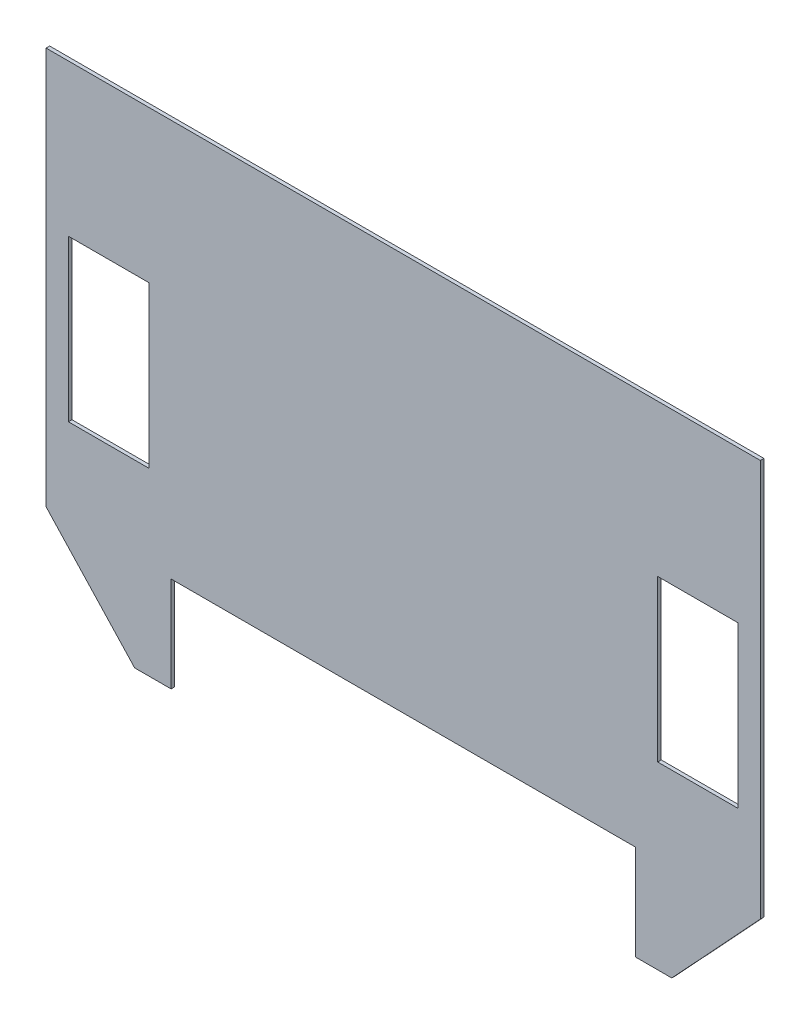
ISO-10303-21;
HEADER;
FILE_DESCRIPTION(('STEP AP214'),'2;1');
FILE_NAME('part.step','',(''),(''),'','','');
FILE_SCHEMA(('AUTOMOTIVE_DESIGN { 1 0 10303 214 1 1 1 1 }'));
ENDSEC;
DATA;
#1=APPLICATION_CONTEXT('core data for automotive mechanical design processes');
#2=APPLICATION_PROTOCOL_DEFINITION('international standard','automotive_design',2000,#1);
#3=PRODUCT_CONTEXT('',#1,'mechanical');
#4=PRODUCT('Part','Part','',(#3));
#5=PRODUCT_RELATED_PRODUCT_CATEGORY('part','',(#4));
#6=PRODUCT_DEFINITION_FORMATION('','',#4);
#7=PRODUCT_DEFINITION_CONTEXT('part definition',#1,'design');
#8=PRODUCT_DEFINITION('design','',#6,#7);
#9=PRODUCT_DEFINITION_SHAPE('','',#8);
#10=(LENGTH_UNIT() NAMED_UNIT(*) SI_UNIT(.MILLI.,.METRE.));
#11=(NAMED_UNIT(*) PLANE_ANGLE_UNIT() SI_UNIT($,.RADIAN.));
#12=(NAMED_UNIT(*) SI_UNIT($,.STERADIAN.) SOLID_ANGLE_UNIT());
#13=UNCERTAINTY_MEASURE_WITH_UNIT(LENGTH_MEASURE(1.E-05),#10,'distance_accuracy_value','');
#14=(GEOMETRIC_REPRESENTATION_CONTEXT(3) GLOBAL_UNCERTAINTY_ASSIGNED_CONTEXT((#13)) GLOBAL_UNIT_ASSIGNED_CONTEXT((#10,
#11,#12)) REPRESENTATION_CONTEXT('',''));
#15=CARTESIAN_POINT('',(0.,0.,0.));
#16=DIRECTION('',(0.,0.,1.));
#17=DIRECTION('',(1.,0.,0.));
#18=AXIS2_PLACEMENT_3D('',#15,#16,#17);
#19=CARTESIAN_POINT('',(0.,0.,2.));
#20=DIRECTION('',(0.,0.,-1.));
#21=DIRECTION('',(-1.,0.,0.));
#22=AXIS2_PLACEMENT_3D('',#19,#20,#21);
#23=PLANE('',#22);
#24=DIRECTION('',(0.,1.,0.));
#25=VECTOR('',#24,1.);
#26=CARTESIAN_POINT('',(-142.5,-85.,2.));
#27=LINE('',#26,#25);
#28=CARTESIAN_POINT('',(-142.5,-175.,2.));
#29=VERTEX_POINT('',#28);
#30=CARTESIAN_POINT('',(-142.5,-85.,2.));
#31=VERTEX_POINT('',#30);
#32=EDGE_CURVE('E213',#29,#31,#27,.T.);
#33=ORIENTED_EDGE('',*,*,#32,.F.);
#34=DIRECTION('',(1.,0.,0.));
#35=VECTOR('',#34,1.);
#36=CARTESIAN_POINT('',(-187.5,-175.,2.));
#37=LINE('',#36,#35);
#38=CARTESIAN_POINT('',(-187.5,-175.,2.));
#39=VERTEX_POINT('',#38);
#40=EDGE_CURVE('E224',#39,#29,#37,.T.);
#41=ORIENTED_EDGE('',*,*,#40,.F.);
#42=DIRECTION('',(0.,-1.,0.));
#43=VECTOR('',#42,1.);
#44=CARTESIAN_POINT('',(-187.5,-85.,2.));
#45=LINE('',#44,#43);
#46=CARTESIAN_POINT('',(-187.5,-85.,2.));
#47=VERTEX_POINT('',#46);
#48=EDGE_CURVE('E220',#47,#39,#45,.T.);
#49=ORIENTED_EDGE('',*,*,#48,.F.);
#50=DIRECTION('',(-1.,0.,0.));
#51=VECTOR('',#50,1.);
#52=CARTESIAN_POINT('',(-187.5,-85.,2.));
#53=LINE('',#52,#51);
#54=EDGE_CURVE('E216',#31,#47,#53,.T.);
#55=ORIENTED_EDGE('',*,*,#54,.F.);
#56=EDGE_LOOP('',(#33,#41,#49,#55));
#57=FACE_BOUND('',#56,.T.);
#58=DIRECTION('',(0.,-1.,0.));
#59=VECTOR('',#58,1.);
#60=CARTESIAN_POINT('',(130.,-275.82,2.));
#61=LINE('',#60,#59);
#62=CARTESIAN_POINT('',(130.,-222.5,2.));
#63=VERTEX_POINT('',#62);
#64=CARTESIAN_POINT('',(130.,-275.82,2.));
#65=VERTEX_POINT('',#64);
#66=EDGE_CURVE('E256',#63,#65,#61,.T.);
#67=ORIENTED_EDGE('',*,*,#66,.T.);
#68=DIRECTION('',(1.,0.,0.));
#69=VECTOR('',#68,1.);
#70=CARTESIAN_POINT('',(150.404334866845,-275.82,2.));
#71=LINE('',#70,#69);
#72=CARTESIAN_POINT('',(150.404334866845,-275.82,2.));
#73=VERTEX_POINT('',#72);
#74=EDGE_CURVE('E260',#65,#73,#71,.T.);
#75=ORIENTED_EDGE('',*,*,#74,.T.);
#76=DIRECTION('',(0.681072028744227,0.732216424059324,0.));
#77=VECTOR('',#76,1.);
#78=CARTESIAN_POINT('',(200.,-222.5,2.));
#79=LINE('',#78,#77);
#80=CARTESIAN_POINT('',(200.,-222.5,2.));
#81=VERTEX_POINT('',#80);
#82=EDGE_CURVE('E264',#73,#81,#79,.T.);
#83=ORIENTED_EDGE('',*,*,#82,.T.);
#84=DIRECTION('',(0.,1.,0.));
#85=VECTOR('',#84,1.);
#86=CARTESIAN_POINT('',(200.,0.,2.));
#87=LINE('',#86,#85);
#88=CARTESIAN_POINT('',(200.,0.,2.));
#89=VERTEX_POINT('',#88);
#90=EDGE_CURVE('E267',#81,#89,#87,.T.);
#91=ORIENTED_EDGE('',*,*,#90,.T.);
#92=DIRECTION('',(-1.,0.,0.));
#93=VECTOR('',#92,1.);
#94=CARTESIAN_POINT('',(200.,0.,2.));
#95=LINE('',#94,#93);
#96=CARTESIAN_POINT('',(-200.,0.,2.));
#97=VERTEX_POINT('',#96);
#98=EDGE_CURVE('E270',#89,#97,#95,.T.);
#99=ORIENTED_EDGE('',*,*,#98,.T.);
#100=DIRECTION('',(0.,-1.,0.));
#101=VECTOR('',#100,1.);
#102=CARTESIAN_POINT('',(-200.,0.,2.));
#103=LINE('',#102,#101);
#104=CARTESIAN_POINT('',(-200.,-222.5,2.));
#105=VERTEX_POINT('',#104);
#106=EDGE_CURVE('E273',#97,#105,#103,.T.);
#107=ORIENTED_EDGE('',*,*,#106,.T.);
#108=DIRECTION('',(0.681072028744227,-0.732216424059324,0.));
#109=VECTOR('',#108,1.);
#110=CARTESIAN_POINT('',(-200.,-222.5,2.));
#111=LINE('',#110,#109);
#112=CARTESIAN_POINT('',(-150.404334866845,-275.82,2.));
#113=VERTEX_POINT('',#112);
#114=EDGE_CURVE('E276',#105,#113,#111,.T.);
#115=ORIENTED_EDGE('',*,*,#114,.T.);
#116=DIRECTION('',(1.,0.,0.));
#117=VECTOR('',#116,1.);
#118=CARTESIAN_POINT('',(-150.404334866845,-275.82,2.));
#119=LINE('',#118,#117);
#120=CARTESIAN_POINT('',(-130.,-275.82,2.));
#121=VERTEX_POINT('',#120);
#122=EDGE_CURVE('E279',#113,#121,#119,.T.);
#123=ORIENTED_EDGE('',*,*,#122,.T.);
#124=DIRECTION('',(0.,1.,0.));
#125=VECTOR('',#124,1.);
#126=CARTESIAN_POINT('',(-130.,-275.82,2.));
#127=LINE('',#126,#125);
#128=CARTESIAN_POINT('',(-130.,-222.5,2.));
#129=VERTEX_POINT('',#128);
#130=EDGE_CURVE('E282',#121,#129,#127,.T.);
#131=ORIENTED_EDGE('',*,*,#130,.T.);
#132=DIRECTION('',(1.,0.,0.));
#133=VECTOR('',#132,1.);
#134=CARTESIAN_POINT('',(-130.,-222.5,2.));
#135=LINE('',#134,#133);
#136=EDGE_CURVE('E285',#129,#63,#135,.T.);
#137=ORIENTED_EDGE('',*,*,#136,.T.);
#138=EDGE_LOOP('',(#67,#75,#83,#91,#99,#107,#115,#123,#131,#137));
#139=FACE_BOUND('',#138,.T.);
#140=DIRECTION('',(-1.,0.,0.));
#141=VECTOR('',#140,1.);
#142=CARTESIAN_POINT('',(187.5,-84.9999999999999,2.));
#143=LINE('',#142,#141);
#144=CARTESIAN_POINT('',(187.5,-84.9999999999999,2.));
#145=VERTEX_POINT('',#144);
#146=CARTESIAN_POINT('',(142.5,-85.,2.));
#147=VERTEX_POINT('',#146);
#148=EDGE_CURVE('E165',#145,#147,#143,.T.);
#149=ORIENTED_EDGE('',*,*,#148,.F.);
#150=DIRECTION('',(0.,1.,0.));
#151=VECTOR('',#150,1.);
#152=CARTESIAN_POINT('',(187.5,-84.9999999999999,2.));
#153=LINE('',#152,#151);
#154=CARTESIAN_POINT('',(187.5,-175.,2.));
#155=VERTEX_POINT('',#154);
#156=EDGE_CURVE('E191',#155,#145,#153,.T.);
#157=ORIENTED_EDGE('',*,*,#156,.F.);
#158=DIRECTION('',(1.,0.,0.));
#159=VECTOR('',#158,1.);
#160=CARTESIAN_POINT('',(187.5,-175.,2.));
#161=LINE('',#160,#159);
#162=CARTESIAN_POINT('',(142.5,-175.,2.));
#163=VERTEX_POINT('',#162);
#164=EDGE_CURVE('E187',#163,#155,#161,.T.);
#165=ORIENTED_EDGE('',*,*,#164,.F.);
#166=DIRECTION('',(0.,-1.,0.));
#167=VECTOR('',#166,1.);
#168=CARTESIAN_POINT('',(142.5,-85.,2.));
#169=LINE('',#168,#167);
#170=EDGE_CURVE('E174',#147,#163,#169,.T.);
#171=ORIENTED_EDGE('',*,*,#170,.F.);
#172=EDGE_LOOP('',(#149,#157,#165,#171));
#173=FACE_BOUND('',#172,.T.);
#174=ADVANCED_FACE('F39',(#57,#139,#173),#23,.F.);
#175=CARTESIAN_POINT('',(0.,0.,0.));
#176=DIRECTION('',(0.,0.,-1.));
#177=DIRECTION('',(-1.,0.,0.));
#178=AXIS2_PLACEMENT_3D('',#175,#176,#177);
#179=PLANE('',#178);
#180=DIRECTION('',(0.,-1.,0.));
#181=VECTOR('',#180,1.);
#182=CARTESIAN_POINT('',(130.,-275.82,0.));
#183=LINE('',#182,#181);
#184=CARTESIAN_POINT('',(130.,-222.5,0.));
#185=VERTEX_POINT('',#184);
#186=CARTESIAN_POINT('',(130.,-275.82,0.));
#187=VERTEX_POINT('',#186);
#188=EDGE_CURVE('E255',#185,#187,#183,.T.);
#189=ORIENTED_EDGE('',*,*,#188,.F.);
#190=DIRECTION('',(1.,0.,0.));
#191=VECTOR('',#190,1.);
#192=CARTESIAN_POINT('',(-130.,-222.5,0.));
#193=LINE('',#192,#191);
#194=CARTESIAN_POINT('',(-130.,-222.5,0.));
#195=VERTEX_POINT('',#194);
#196=EDGE_CURVE('E261',#195,#185,#193,.T.);
#197=ORIENTED_EDGE('',*,*,#196,.F.);
#198=DIRECTION('',(0.,1.,0.));
#199=VECTOR('',#198,1.);
#200=CARTESIAN_POINT('',(-130.,-275.82,0.));
#201=LINE('',#200,#199);
#202=CARTESIAN_POINT('',(-130.,-275.82,0.));
#203=VERTEX_POINT('',#202);
#204=EDGE_CURVE('E313',#203,#195,#201,.T.);
#205=ORIENTED_EDGE('',*,*,#204,.F.);
#206=DIRECTION('',(1.,0.,0.));
#207=VECTOR('',#206,1.);
#208=CARTESIAN_POINT('',(-150.404334866845,-275.82,0.));
#209=LINE('',#208,#207);
#210=CARTESIAN_POINT('',(-150.404334866845,-275.82,0.));
#211=VERTEX_POINT('',#210);
#212=EDGE_CURVE('E310',#211,#203,#209,.T.);
#213=ORIENTED_EDGE('',*,*,#212,.F.);
#214=DIRECTION('',(0.681072028744227,-0.732216424059324,0.));
#215=VECTOR('',#214,1.);
#216=CARTESIAN_POINT('',(-200.,-222.5,0.));
#217=LINE('',#216,#215);
#218=CARTESIAN_POINT('',(-200.,-222.5,0.));
#219=VERTEX_POINT('',#218);
#220=EDGE_CURVE('E307',#219,#211,#217,.T.);
#221=ORIENTED_EDGE('',*,*,#220,.F.);
#222=DIRECTION('',(0.,-1.,0.));
#223=VECTOR('',#222,1.);
#224=CARTESIAN_POINT('',(-200.,0.,0.));
#225=LINE('',#224,#223);
#226=CARTESIAN_POINT('',(-200.,0.,0.));
#227=VERTEX_POINT('',#226);
#228=EDGE_CURVE('E304',#227,#219,#225,.T.);
#229=ORIENTED_EDGE('',*,*,#228,.F.);
#230=DIRECTION('',(-1.,0.,0.));
#231=VECTOR('',#230,1.);
#232=CARTESIAN_POINT('',(200.,0.,0.));
#233=LINE('',#232,#231);
#234=CARTESIAN_POINT('',(200.,0.,0.));
#235=VERTEX_POINT('',#234);
#236=EDGE_CURVE('E301',#235,#227,#233,.T.);
#237=ORIENTED_EDGE('',*,*,#236,.F.);
#238=DIRECTION('',(0.,1.,0.));
#239=VECTOR('',#238,1.);
#240=CARTESIAN_POINT('',(200.,0.,0.));
#241=LINE('',#240,#239);
#242=CARTESIAN_POINT('',(200.,-222.5,0.));
#243=VERTEX_POINT('',#242);
#244=EDGE_CURVE('E298',#243,#235,#241,.T.);
#245=ORIENTED_EDGE('',*,*,#244,.F.);
#246=DIRECTION('',(0.681072028744227,0.732216424059324,0.));
#247=VECTOR('',#246,1.);
#248=CARTESIAN_POINT('',(200.,-222.5,0.));
#249=LINE('',#248,#247);
#250=CARTESIAN_POINT('',(150.404334866845,-275.82,0.));
#251=VERTEX_POINT('',#250);
#252=EDGE_CURVE('E295',#251,#243,#249,.T.);
#253=ORIENTED_EDGE('',*,*,#252,.F.);
#254=DIRECTION('',(1.,0.,0.));
#255=VECTOR('',#254,1.);
#256=CARTESIAN_POINT('',(150.404334866845,-275.82,0.));
#257=LINE('',#256,#255);
#258=EDGE_CURVE('E292',#187,#251,#257,.T.);
#259=ORIENTED_EDGE('',*,*,#258,.F.);
#260=EDGE_LOOP('',(#189,#197,#205,#213,#221,#229,#237,#245,#253,#259));
#261=FACE_BOUND('',#260,.T.);
#262=DIRECTION('',(1.,0.,0.));
#263=VECTOR('',#262,1.);
#264=CARTESIAN_POINT('',(-187.5,-175.,0.));
#265=LINE('',#264,#263);
#266=CARTESIAN_POINT('',(-187.5,-175.,0.));
#267=VERTEX_POINT('',#266);
#268=CARTESIAN_POINT('',(-142.5,-175.,0.));
#269=VERTEX_POINT('',#268);
#270=EDGE_CURVE('E217',#267,#269,#265,.T.);
#271=ORIENTED_EDGE('',*,*,#270,.T.);
#272=DIRECTION('',(0.,1.,0.));
#273=VECTOR('',#272,1.);
#274=CARTESIAN_POINT('',(-142.5,-85.,0.));
#275=LINE('',#274,#273);
#276=CARTESIAN_POINT('',(-142.5,-85.,0.));
#277=VERTEX_POINT('',#276);
#278=EDGE_CURVE('E183',#269,#277,#275,.T.);
#279=ORIENTED_EDGE('',*,*,#278,.T.);
#280=DIRECTION('',(-1.,0.,0.));
#281=VECTOR('',#280,1.);
#282=CARTESIAN_POINT('',(-187.5,-85.,0.));
#283=LINE('',#282,#281);
#284=CARTESIAN_POINT('',(-187.5,-85.,0.));
#285=VERTEX_POINT('',#284);
#286=EDGE_CURVE('E231',#277,#285,#283,.T.);
#287=ORIENTED_EDGE('',*,*,#286,.T.);
#288=DIRECTION('',(0.,-1.,0.));
#289=VECTOR('',#288,1.);
#290=CARTESIAN_POINT('',(-187.5,-85.,0.));
#291=LINE('',#290,#289);
#292=EDGE_CURVE('E235',#285,#267,#291,.T.);
#293=ORIENTED_EDGE('',*,*,#292,.T.);
#294=EDGE_LOOP('',(#271,#279,#287,#293));
#295=FACE_BOUND('',#294,.T.);
#296=DIRECTION('',(0.,1.,0.));
#297=VECTOR('',#296,1.);
#298=CARTESIAN_POINT('',(187.5,-84.9999999999999,0.));
#299=LINE('',#298,#297);
#300=CARTESIAN_POINT('',(187.5,-175.,0.));
#301=VERTEX_POINT('',#300);
#302=CARTESIAN_POINT('',(187.5,-84.9999999999999,0.));
#303=VERTEX_POINT('',#302);
#304=EDGE_CURVE('E175',#301,#303,#299,.T.);
#305=ORIENTED_EDGE('',*,*,#304,.T.);
#306=DIRECTION('',(-1.,0.,0.));
#307=VECTOR('',#306,1.);
#308=CARTESIAN_POINT('',(187.5,-84.9999999999999,0.));
#309=LINE('',#308,#307);
#310=CARTESIAN_POINT('',(142.5,-85.,0.));
#311=VERTEX_POINT('',#310);
#312=EDGE_CURVE('E63',#303,#311,#309,.T.);
#313=ORIENTED_EDGE('',*,*,#312,.T.);
#314=DIRECTION('',(0.,-1.,0.));
#315=VECTOR('',#314,1.);
#316=CARTESIAN_POINT('',(142.5,-85.,0.));
#317=LINE('',#316,#315);
#318=CARTESIAN_POINT('',(142.5,-175.,0.));
#319=VERTEX_POINT('',#318);
#320=EDGE_CURVE('E181',#311,#319,#317,.T.);
#321=ORIENTED_EDGE('',*,*,#320,.T.);
#322=DIRECTION('',(1.,0.,0.));
#323=VECTOR('',#322,1.);
#324=CARTESIAN_POINT('',(187.5,-175.,0.));
#325=LINE('',#324,#323);
#326=EDGE_CURVE('E200',#319,#301,#325,.T.);
#327=ORIENTED_EDGE('',*,*,#326,.T.);
#328=EDGE_LOOP('',(#305,#313,#321,#327));
#329=FACE_BOUND('',#328,.T.);
#330=ADVANCED_FACE('F360',(#261,#295,#329),#179,.T.);
#331=CARTESIAN_POINT('',(130.,-275.82,2.));
#332=DIRECTION('',(1.,0.,0.));
#333=DIRECTION('',(0.,1.,0.));
#334=AXIS2_PLACEMENT_3D('',#331,#332,#333);
#335=PLANE('',#334);
#336=ORIENTED_EDGE('',*,*,#188,.T.);
#337=DIRECTION('',(0.,0.,-1.));
#338=VECTOR('',#337,1.);
#339=CARTESIAN_POINT('',(130.,-275.82,2.));
#340=LINE('',#339,#338);
#341=EDGE_CURVE('E11',#65,#187,#340,.T.);
#342=ORIENTED_EDGE('',*,*,#341,.F.);
#343=ORIENTED_EDGE('',*,*,#66,.F.);
#344=DIRECTION('',(0.,0.,-1.));
#345=VECTOR('',#344,1.);
#346=CARTESIAN_POINT('',(130.,-222.5,2.));
#347=LINE('',#346,#345);
#348=EDGE_CURVE('E288',#63,#185,#347,.T.);
#349=ORIENTED_EDGE('',*,*,#348,.T.);
#350=EDGE_LOOP('',(#336,#342,#343,#349));
#351=FACE_BOUND('',#350,.T.);
#352=ADVANCED_FACE('F41',(#351),#335,.F.);
#353=CARTESIAN_POINT('',(150.404334866845,-275.82,2.));
#354=DIRECTION('',(0.,1.,0.));
#355=DIRECTION('',(0.,0.,1.));
#356=AXIS2_PLACEMENT_3D('',#353,#354,#355);
#357=PLANE('',#356);
#358=ORIENTED_EDGE('',*,*,#258,.T.);
#359=DIRECTION('',(0.,0.,-1.));
#360=VECTOR('',#359,1.);
#361=CARTESIAN_POINT('',(150.404334866845,-275.82,2.));
#362=LINE('',#361,#360);
#363=EDGE_CURVE('E48',#73,#251,#362,.T.);
#364=ORIENTED_EDGE('',*,*,#363,.F.);
#365=ORIENTED_EDGE('',*,*,#74,.F.);
#366=ORIENTED_EDGE('',*,*,#341,.T.);
#367=EDGE_LOOP('',(#358,#364,#365,#366));
#368=FACE_BOUND('',#367,.T.);
#369=ADVANCED_FACE('F377',(#368),#357,.F.);
#370=CARTESIAN_POINT('',(200.,-222.5,2.));
#371=DIRECTION('',(-0.732216424059324,0.681072028744227,0.));
#372=DIRECTION('',(-0.681072028744227,-0.732216424059324,0.));
#373=AXIS2_PLACEMENT_3D('',#370,#371,#372);
#374=PLANE('',#373);
#375=ORIENTED_EDGE('',*,*,#252,.T.);
#376=DIRECTION('',(0.,0.,-1.));
#377=VECTOR('',#376,1.);
#378=CARTESIAN_POINT('',(200.,-222.5,2.));
#379=LINE('',#378,#377);
#380=EDGE_CURVE('E345',#81,#243,#379,.T.);
#381=ORIENTED_EDGE('',*,*,#380,.F.);
#382=ORIENTED_EDGE('',*,*,#82,.F.);
#383=ORIENTED_EDGE('',*,*,#363,.T.);
#384=EDGE_LOOP('',(#375,#381,#382,#383));
#385=FACE_BOUND('',#384,.T.);
#386=ADVANCED_FACE('F354',(#385),#374,.F.);
#387=CARTESIAN_POINT('',(200.,0.,2.));
#388=DIRECTION('',(-1.,0.,0.));
#389=DIRECTION('',(0.,-1.,0.));
#390=AXIS2_PLACEMENT_3D('',#387,#388,#389);
#391=PLANE('',#390);
#392=ORIENTED_EDGE('',*,*,#244,.T.);
#393=DIRECTION('',(0.,0.,-1.));
#394=VECTOR('',#393,1.);
#395=CARTESIAN_POINT('',(200.,0.,2.));
#396=LINE('',#395,#394);
#397=EDGE_CURVE('E341',#89,#235,#396,.T.);
#398=ORIENTED_EDGE('',*,*,#397,.F.);
#399=ORIENTED_EDGE('',*,*,#90,.F.);
#400=ORIENTED_EDGE('',*,*,#380,.T.);
#401=EDGE_LOOP('',(#392,#398,#399,#400));
#402=FACE_BOUND('',#401,.T.);
#403=ADVANCED_FACE('F366',(#402),#391,.F.);
#404=CARTESIAN_POINT('',(200.,0.,2.));
#405=DIRECTION('',(0.,-1.,0.));
#406=DIRECTION('',(1.,0.,0.));
#407=AXIS2_PLACEMENT_3D('',#404,#405,#406);
#408=PLANE('',#407);
#409=ORIENTED_EDGE('',*,*,#236,.T.);
#410=DIRECTION('',(0.,0.,-1.));
#411=VECTOR('',#410,1.);
#412=CARTESIAN_POINT('',(-200.,0.,2.));
#413=LINE('',#412,#411);
#414=EDGE_CURVE('E337',#97,#227,#413,.T.);
#415=ORIENTED_EDGE('',*,*,#414,.F.);
#416=ORIENTED_EDGE('',*,*,#98,.F.);
#417=ORIENTED_EDGE('',*,*,#397,.T.);
#418=EDGE_LOOP('',(#409,#415,#416,#417));
#419=FACE_BOUND('',#418,.T.);
#420=ADVANCED_FACE('F370',(#419),#408,.F.);
#421=CARTESIAN_POINT('',(-200.,0.,2.));
#422=DIRECTION('',(1.,0.,0.));
#423=DIRECTION('',(0.,0.,-1.));
#424=AXIS2_PLACEMENT_3D('',#421,#422,#423);
#425=PLANE('',#424);
#426=ORIENTED_EDGE('',*,*,#228,.T.);
#427=DIRECTION('',(0.,0.,-1.));
#428=VECTOR('',#427,1.);
#429=CARTESIAN_POINT('',(-200.,-222.5,2.));
#430=LINE('',#429,#428);
#431=EDGE_CURVE('E333',#105,#219,#430,.T.);
#432=ORIENTED_EDGE('',*,*,#431,.F.);
#433=ORIENTED_EDGE('',*,*,#106,.F.);
#434=ORIENTED_EDGE('',*,*,#414,.T.);
#435=EDGE_LOOP('',(#426,#432,#433,#434));
#436=FACE_BOUND('',#435,.T.);
#437=ADVANCED_FACE('F400',(#436),#425,.F.);
#438=CARTESIAN_POINT('',(-200.,-222.5,2.));
#439=DIRECTION('',(0.732216424059324,0.681072028744227,0.));
#440=DIRECTION('',(-0.681072028744227,0.732216424059324,0.));
#441=AXIS2_PLACEMENT_3D('',#438,#439,#440);
#442=PLANE('',#441);
#443=ORIENTED_EDGE('',*,*,#220,.T.);
#444=DIRECTION('',(0.,0.,-1.));
#445=VECTOR('',#444,1.);
#446=CARTESIAN_POINT('',(-150.404334866845,-275.82,2.));
#447=LINE('',#446,#445);
#448=EDGE_CURVE('E329',#113,#211,#447,.T.);
#449=ORIENTED_EDGE('',*,*,#448,.F.);
#450=ORIENTED_EDGE('',*,*,#114,.F.);
#451=ORIENTED_EDGE('',*,*,#431,.T.);
#452=EDGE_LOOP('',(#443,#449,#450,#451));
#453=FACE_BOUND('',#452,.T.);
#454=ADVANCED_FACE('F397',(#453),#442,.F.);
#455=CARTESIAN_POINT('',(-150.404334866845,-275.82,2.));
#456=DIRECTION('',(0.,1.,0.));
#457=DIRECTION('',(0.,0.,1.));
#458=AXIS2_PLACEMENT_3D('',#455,#456,#457);
#459=PLANE('',#458);
#460=ORIENTED_EDGE('',*,*,#212,.T.);
#461=DIRECTION('',(0.,0.,-1.));
#462=VECTOR('',#461,1.);
#463=CARTESIAN_POINT('',(-130.,-275.82,2.));
#464=LINE('',#463,#462);
#465=EDGE_CURVE('E325',#121,#203,#464,.T.);
#466=ORIENTED_EDGE('',*,*,#465,.F.);
#467=ORIENTED_EDGE('',*,*,#122,.F.);
#468=ORIENTED_EDGE('',*,*,#448,.T.);
#469=EDGE_LOOP('',(#460,#466,#467,#468));
#470=FACE_BOUND('',#469,.T.);
#471=ADVANCED_FACE('F393',(#470),#459,.F.);
#472=CARTESIAN_POINT('',(-130.,-275.82,2.));
#473=DIRECTION('',(-1.,0.,0.));
#474=DIRECTION('',(0.,-1.,0.));
#475=AXIS2_PLACEMENT_3D('',#472,#473,#474);
#476=PLANE('',#475);
#477=ORIENTED_EDGE('',*,*,#204,.T.);
#478=DIRECTION('',(0.,0.,-1.));
#479=VECTOR('',#478,1.);
#480=CARTESIAN_POINT('',(-130.,-222.5,2.));
#481=LINE('',#480,#479);
#482=EDGE_CURVE('E321',#129,#195,#481,.T.);
#483=ORIENTED_EDGE('',*,*,#482,.F.);
#484=ORIENTED_EDGE('',*,*,#130,.F.);
#485=ORIENTED_EDGE('',*,*,#465,.T.);
#486=EDGE_LOOP('',(#477,#483,#484,#485));
#487=FACE_BOUND('',#486,.T.);
#488=ADVANCED_FACE('F389',(#487),#476,.F.);
#489=CARTESIAN_POINT('',(-130.,-222.5,2.));
#490=DIRECTION('',(0.,1.,0.));
#491=DIRECTION('',(-1.,0.,0.));
#492=AXIS2_PLACEMENT_3D('',#489,#490,#491);
#493=PLANE('',#492);
#494=ORIENTED_EDGE('',*,*,#196,.T.);
#495=ORIENTED_EDGE('',*,*,#348,.F.);
#496=ORIENTED_EDGE('',*,*,#136,.F.);
#497=ORIENTED_EDGE('',*,*,#482,.T.);
#498=EDGE_LOOP('',(#494,#495,#496,#497));
#499=FACE_BOUND('',#498,.T.);
#500=ADVANCED_FACE('F384',(#499),#493,.F.);
#501=CARTESIAN_POINT('',(-142.5,-85.,2.));
#502=DIRECTION('',(-1.,0.,0.));
#503=DIRECTION('',(0.,-1.,0.));
#504=AXIS2_PLACEMENT_3D('',#501,#502,#503);
#505=PLANE('',#504);
#506=ORIENTED_EDGE('',*,*,#278,.F.);
#507=DIRECTION('',(0.,0.,-1.));
#508=VECTOR('',#507,1.);
#509=CARTESIAN_POINT('',(-142.5,-175.,2.));
#510=LINE('',#509,#508);
#511=EDGE_CURVE('E227',#29,#269,#510,.T.);
#512=ORIENTED_EDGE('',*,*,#511,.F.);
#513=ORIENTED_EDGE('',*,*,#32,.T.);
#514=DIRECTION('',(0.,0.,-1.));
#515=VECTOR('',#514,1.);
#516=CARTESIAN_POINT('',(-142.5,-85.,2.));
#517=LINE('',#516,#515);
#518=EDGE_CURVE('E251',#31,#277,#517,.T.);
#519=ORIENTED_EDGE('',*,*,#518,.T.);
#520=EDGE_LOOP('',(#506,#512,#513,#519));
#521=FACE_BOUND('',#520,.T.);
#522=ADVANCED_FACE('F418',(#521),#505,.T.);
#523=CARTESIAN_POINT('',(-187.5,-85.,2.));
#524=DIRECTION('',(0.,-1.,0.));
#525=DIRECTION('',(1.,0.,0.));
#526=AXIS2_PLACEMENT_3D('',#523,#524,#525);
#527=PLANE('',#526);
#528=ORIENTED_EDGE('',*,*,#286,.F.);
#529=ORIENTED_EDGE('',*,*,#518,.F.);
#530=ORIENTED_EDGE('',*,*,#54,.T.);
#531=DIRECTION('',(0.,0.,-1.));
#532=VECTOR('',#531,1.);
#533=CARTESIAN_POINT('',(-187.5,-85.,2.));
#534=LINE('',#533,#532);
#535=EDGE_CURVE('E248',#47,#285,#534,.T.);
#536=ORIENTED_EDGE('',*,*,#535,.T.);
#537=EDGE_LOOP('',(#528,#529,#530,#536));
#538=FACE_BOUND('',#537,.T.);
#539=ADVANCED_FACE('F444',(#538),#527,.T.);
#540=CARTESIAN_POINT('',(-187.5,-85.,2.));
#541=DIRECTION('',(1.,0.,0.));
#542=DIRECTION('',(0.,0.,-1.));
#543=AXIS2_PLACEMENT_3D('',#540,#541,#542);
#544=PLANE('',#543);
#545=ORIENTED_EDGE('',*,*,#292,.F.);
#546=ORIENTED_EDGE('',*,*,#535,.F.);
#547=ORIENTED_EDGE('',*,*,#48,.T.);
#548=DIRECTION('',(0.,0.,-1.));
#549=VECTOR('',#548,1.);
#550=CARTESIAN_POINT('',(-187.5,-175.,2.));
#551=LINE('',#550,#549);
#552=EDGE_CURVE('E245',#39,#267,#551,.T.);
#553=ORIENTED_EDGE('',*,*,#552,.T.);
#554=EDGE_LOOP('',(#545,#546,#547,#553));
#555=FACE_BOUND('',#554,.T.);
#556=ADVANCED_FACE('F451',(#555),#544,.T.);
#557=CARTESIAN_POINT('',(-187.5,-175.,2.));
#558=DIRECTION('',(0.,1.,0.));
#559=DIRECTION('',(0.,0.,1.));
#560=AXIS2_PLACEMENT_3D('',#557,#558,#559);
#561=PLANE('',#560);
#562=ORIENTED_EDGE('',*,*,#270,.F.);
#563=ORIENTED_EDGE('',*,*,#552,.F.);
#564=ORIENTED_EDGE('',*,*,#40,.T.);
#565=ORIENTED_EDGE('',*,*,#511,.T.);
#566=EDGE_LOOP('',(#562,#563,#564,#565));
#567=FACE_BOUND('',#566,.T.);
#568=ADVANCED_FACE('F458',(#567),#561,.T.);
#569=CARTESIAN_POINT('',(187.5,-84.9999999999999,2.));
#570=DIRECTION('',(0.,-1.,0.));
#571=DIRECTION('',(1.,0.,0.));
#572=AXIS2_PLACEMENT_3D('',#569,#570,#571);
#573=PLANE('',#572);
#574=ORIENTED_EDGE('',*,*,#312,.F.);
#575=DIRECTION('',(0.,0.,-1.));
#576=VECTOR('',#575,1.);
#577=CARTESIAN_POINT('',(187.5,-84.9999999999999,2.));
#578=LINE('',#577,#576);
#579=EDGE_CURVE('E169',#145,#303,#578,.T.);
#580=ORIENTED_EDGE('',*,*,#579,.F.);
#581=ORIENTED_EDGE('',*,*,#148,.T.);
#582=DIRECTION('',(0.,0.,-1.));
#583=VECTOR('',#582,1.);
#584=CARTESIAN_POINT('',(142.5,-85.,2.));
#585=LINE('',#584,#583);
#586=EDGE_CURVE('E168',#147,#311,#585,.T.);
#587=ORIENTED_EDGE('',*,*,#586,.T.);
#588=EDGE_LOOP('',(#574,#580,#581,#587));
#589=FACE_BOUND('',#588,.T.);
#590=ADVANCED_FACE('F167',(#589),#573,.T.);
#591=CARTESIAN_POINT('',(142.5,-85.,2.));
#592=DIRECTION('',(1.,0.,0.));
#593=DIRECTION('',(0.,0.,-1.));
#594=AXIS2_PLACEMENT_3D('',#591,#592,#593);
#595=PLANE('',#594);
#596=ORIENTED_EDGE('',*,*,#320,.F.);
#597=ORIENTED_EDGE('',*,*,#586,.F.);
#598=ORIENTED_EDGE('',*,*,#170,.T.);
#599=DIRECTION('',(0.,0.,-1.));
#600=VECTOR('',#599,1.);
#601=CARTESIAN_POINT('',(142.5,-175.,2.));
#602=LINE('',#601,#600);
#603=EDGE_CURVE('E184',#163,#319,#602,.T.);
#604=ORIENTED_EDGE('',*,*,#603,.T.);
#605=EDGE_LOOP('',(#596,#597,#598,#604));
#606=FACE_BOUND('',#605,.T.);
#607=ADVANCED_FACE('F178',(#606),#595,.T.);
#608=CARTESIAN_POINT('',(187.5,-175.,2.));
#609=DIRECTION('',(0.,1.,0.));
#610=DIRECTION('',(-1.,0.,0.));
#611=AXIS2_PLACEMENT_3D('',#608,#609,#610);
#612=PLANE('',#611);
#613=ORIENTED_EDGE('',*,*,#326,.F.);
#614=ORIENTED_EDGE('',*,*,#603,.F.);
#615=ORIENTED_EDGE('',*,*,#164,.T.);
#616=DIRECTION('',(0.,0.,-1.));
#617=VECTOR('',#616,1.);
#618=CARTESIAN_POINT('',(187.5,-175.,2.));
#619=LINE('',#618,#617);
#620=EDGE_CURVE('E55',#155,#301,#619,.T.);
#621=ORIENTED_EDGE('',*,*,#620,.T.);
#622=EDGE_LOOP('',(#613,#614,#615,#621));
#623=FACE_BOUND('',#622,.T.);
#624=ADVANCED_FACE('F479',(#623),#612,.T.);
#625=CARTESIAN_POINT('',(187.5,-84.9999999999999,2.));
#626=DIRECTION('',(-1.,0.,0.));
#627=DIRECTION('',(0.,-1.,0.));
#628=AXIS2_PLACEMENT_3D('',#625,#626,#627);
#629=PLANE('',#628);
#630=ORIENTED_EDGE('',*,*,#304,.F.);
#631=ORIENTED_EDGE('',*,*,#620,.F.);
#632=ORIENTED_EDGE('',*,*,#156,.T.);
#633=ORIENTED_EDGE('',*,*,#579,.T.);
#634=EDGE_LOOP('',(#630,#631,#632,#633));
#635=FACE_BOUND('',#634,.T.);
#636=ADVANCED_FACE('F486',(#635),#629,.T.);
#637=CLOSED_SHELL('',(#174,#330,#352,#369,#386,#403,#420,#437,#454,#471,#488,#500,#522,#539,
#556,#568,#590,#607,#624,#636));
#638=MANIFOLD_SOLID_BREP('B2',#637);
#639=ADVANCED_BREP_SHAPE_REPRESENTATION('',(#18,#638),#14);
#640=SHAPE_DEFINITION_REPRESENTATION(#9,#639);
ENDSEC;
END-ISO-10303-21;
